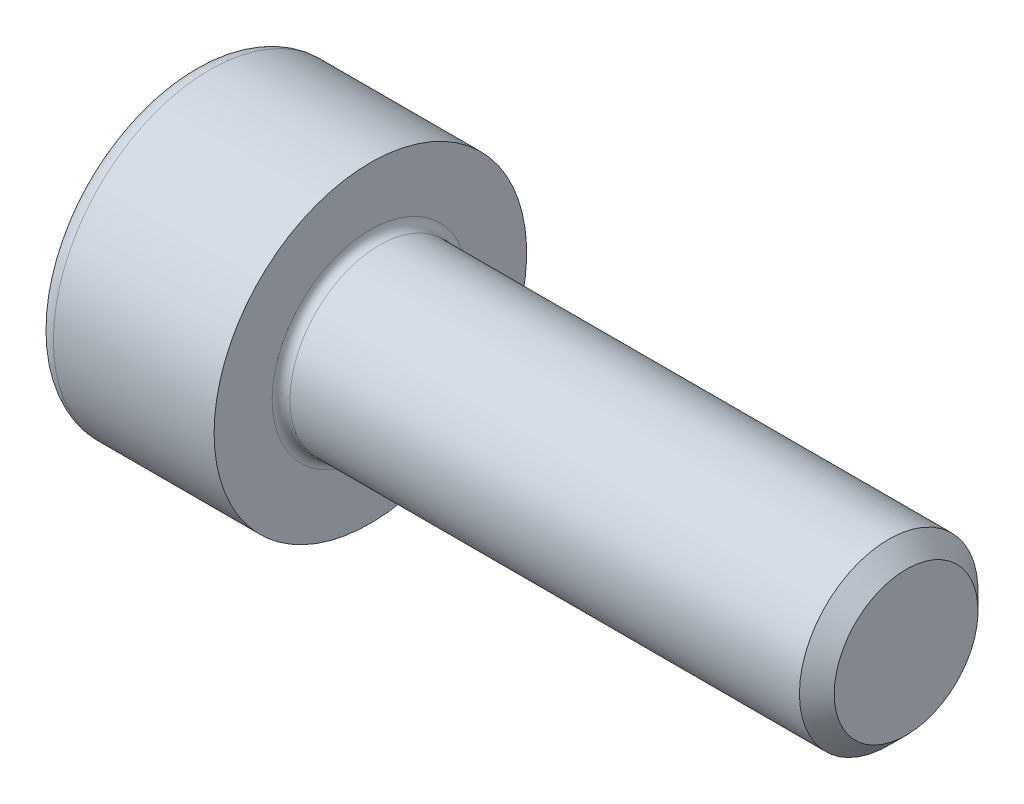
ISO-10303-21;
HEADER;
FILE_DESCRIPTION(('STEP AP214'),'2;1');
FILE_NAME('part.step','',(''),(''),'','','');
FILE_SCHEMA(('AUTOMOTIVE_DESIGN { 1 0 10303 214 1 1 1 1 }'));
ENDSEC;
DATA;
#1=APPLICATION_CONTEXT('core data for automotive mechanical design processes');
#2=APPLICATION_PROTOCOL_DEFINITION('international standard','automotive_design',2000,#1);
#3=PRODUCT_CONTEXT('',#1,'mechanical');
#4=PRODUCT('Part','Part','',(#3));
#5=PRODUCT_RELATED_PRODUCT_CATEGORY('part','',(#4));
#6=PRODUCT_DEFINITION_FORMATION('','',#4);
#7=PRODUCT_DEFINITION_CONTEXT('part definition',#1,'design');
#8=PRODUCT_DEFINITION('design','',#6,#7);
#9=PRODUCT_DEFINITION_SHAPE('','',#8);
#10=(LENGTH_UNIT() NAMED_UNIT(*) SI_UNIT(.MILLI.,.METRE.));
#11=(NAMED_UNIT(*) PLANE_ANGLE_UNIT() SI_UNIT($,.RADIAN.));
#12=(NAMED_UNIT(*) SI_UNIT($,.STERADIAN.) SOLID_ANGLE_UNIT());
#13=UNCERTAINTY_MEASURE_WITH_UNIT(LENGTH_MEASURE(1.E-05),#10,'distance_accuracy_value','');
#14=(GEOMETRIC_REPRESENTATION_CONTEXT(3) GLOBAL_UNCERTAINTY_ASSIGNED_CONTEXT((#13)) GLOBAL_UNIT_ASSIGNED_CONTEXT((#10,
#11,#12)) REPRESENTATION_CONTEXT('',''));
#15=CARTESIAN_POINT('',(0.,0.,0.));
#16=DIRECTION('',(0.,0.,1.));
#17=DIRECTION('',(1.,0.,0.));
#18=AXIS2_PLACEMENT_3D('',#15,#16,#17);
#19=CARTESIAN_POINT('',(0.,0.,0.));
#20=DIRECTION('',(-1.,0.,0.));
#21=DIRECTION('',(0.,0.,1.));
#22=AXIS2_PLACEMENT_3D('',#19,#20,#21);
#23=PLANE('',#22);
#24=DIRECTION('',(0.,-0.499999999999998,0.86602540378444));
#25=VECTOR('',#24,1.);
#26=CARTESIAN_POINT('',(0.,1.74359781295266,0.));
#27=LINE('',#26,#25);
#28=CARTESIAN_POINT('',(0.,1.74359781295266,0.));
#29=VERTEX_POINT('',#28);
#30=CARTESIAN_POINT('',(0.,0.871798906476331,1.51));
#31=VERTEX_POINT('',#30);
#32=EDGE_CURVE('E262',#29,#31,#27,.T.);
#33=ORIENTED_EDGE('',*,*,#32,.T.);
#34=DIRECTION('',(0.,1.,0.));
#35=VECTOR('',#34,1.);
#36=CARTESIAN_POINT('',(0.,-0.871798906476338,1.51));
#37=LINE('',#36,#35);
#38=CARTESIAN_POINT('',(0.,-0.871798906476338,1.51));
#39=VERTEX_POINT('',#38);
#40=EDGE_CURVE('E134',#39,#31,#37,.T.);
#41=ORIENTED_EDGE('',*,*,#40,.F.);
#42=DIRECTION('',(0.,-0.500000000000001,-0.866025403784438));
#43=VECTOR('',#42,1.);
#44=CARTESIAN_POINT('',(0.,-0.871798906476338,1.51));
#45=LINE('',#44,#43);
#46=CARTESIAN_POINT('',(0.,-1.74359781295267,0.));
#47=VERTEX_POINT('',#46);
#48=EDGE_CURVE('E265',#39,#47,#45,.T.);
#49=ORIENTED_EDGE('',*,*,#48,.T.);
#50=DIRECTION('',(0.,0.499999999999998,-0.86602540378444));
#51=VECTOR('',#50,1.);
#52=CARTESIAN_POINT('',(0.,-1.74359781295267,0.));
#53=LINE('',#52,#51);
#54=CARTESIAN_POINT('',(0.,-0.871798906476343,-1.51));
#55=VERTEX_POINT('',#54);
#56=EDGE_CURVE('E268',#47,#55,#53,.T.);
#57=ORIENTED_EDGE('',*,*,#56,.T.);
#58=DIRECTION('',(0.,-1.,0.));
#59=VECTOR('',#58,1.);
#60=CARTESIAN_POINT('',(0.,0.871798906476327,-1.51));
#61=LINE('',#60,#59);
#62=CARTESIAN_POINT('',(0.,0.871798906476327,-1.51));
#63=VERTEX_POINT('',#62);
#64=EDGE_CURVE('E271',#63,#55,#61,.T.);
#65=ORIENTED_EDGE('',*,*,#64,.F.);
#66=DIRECTION('',(0.,-0.500000000000001,-0.866025403784438));
#67=VECTOR('',#66,1.);
#68=CARTESIAN_POINT('',(0.,1.74359781295266,0.));
#69=LINE('',#68,#67);
#70=EDGE_CURVE('E129',#29,#63,#69,.T.);
#71=ORIENTED_EDGE('',*,*,#70,.F.);
#72=EDGE_LOOP('',(#33,#41,#49,#57,#65,#71));
#73=FACE_BOUND('',#72,.T.);
#74=CARTESIAN_POINT('',(0.,0.,0.));
#75=DIRECTION('',(-1.,0.,0.));
#76=DIRECTION('',(0.,0.,1.));
#77=AXIS2_PLACEMENT_3D('',#74,#75,#76);
#78=CIRCLE('',#77,3.1);
#79=CARTESIAN_POINT('',(0.,0.,3.1));
#80=VERTEX_POINT('',#79);
#81=EDGE_CURVE('E46',#80,#80,#78,.T.);
#82=ORIENTED_EDGE('',*,*,#81,.T.);
#83=EDGE_LOOP('',(#82));
#84=FACE_BOUND('',#83,.T.);
#85=ADVANCED_FACE('F38',(#73,#84),#23,.T.);
#86=CARTESIAN_POINT('',(-31.75,0.,0.));
#87=DIRECTION('',(-1.,0.,0.));
#88=DIRECTION('',(0.,0.,1.));
#89=AXIS2_PLACEMENT_3D('',#86,#87,#88);
#90=CYLINDRICAL_SURFACE('',#89,3.5);
#91=CARTESIAN_POINT('',(0.399999999999998,0.,0.));
#92=DIRECTION('',(-1.,0.,0.));
#93=DIRECTION('',(0.,0.,1.));
#94=AXIS2_PLACEMENT_3D('',#91,#92,#93);
#95=CIRCLE('',#94,3.5);
#96=CARTESIAN_POINT('',(0.399999999999998,0.,3.5));
#97=VERTEX_POINT('',#96);
#98=EDGE_CURVE('E11',#97,#97,#95,.F.);
#99=ORIENTED_EDGE('',*,*,#98,.T.);
#100=EDGE_LOOP('',(#99));
#101=FACE_BOUND('',#100,.T.);
#102=CARTESIAN_POINT('',(4.,0.,0.));
#103=DIRECTION('',(-1.,0.,0.));
#104=DIRECTION('',(0.,0.,1.));
#105=AXIS2_PLACEMENT_3D('',#102,#103,#104);
#106=CIRCLE('',#105,3.5);
#107=CARTESIAN_POINT('',(4.,0.,3.5));
#108=VERTEX_POINT('',#107);
#109=EDGE_CURVE('E152',#108,#108,#106,.T.);
#110=ORIENTED_EDGE('',*,*,#109,.T.);
#111=EDGE_LOOP('',(#110));
#112=FACE_BOUND('',#111,.T.);
#113=ADVANCED_FACE('F176',(#101,#112),#90,.T.);
#114=CARTESIAN_POINT('',(4.,3.5,0.));
#115=DIRECTION('',(1.,0.,0.));
#116=DIRECTION('',(0.,0.,-1.));
#117=AXIS2_PLACEMENT_3D('',#114,#115,#116);
#118=PLANE('',#117);
#119=CARTESIAN_POINT('',(4.,0.,0.));
#120=DIRECTION('',(1.,0.,0.));
#121=DIRECTION('',(0.,0.,-1.));
#122=AXIS2_PLACEMENT_3D('',#119,#120,#121);
#123=CIRCLE('',#122,2.19999999999999);
#124=CARTESIAN_POINT('',(4.,0.,-2.19999999999999));
#125=VERTEX_POINT('',#124);
#126=EDGE_CURVE('E155',#125,#125,#123,.F.);
#127=ORIENTED_EDGE('',*,*,#126,.T.);
#128=EDGE_LOOP('',(#127));
#129=FACE_BOUND('',#128,.T.);
#130=ORIENTED_EDGE('',*,*,#109,.F.);
#131=EDGE_LOOP('',(#130));
#132=FACE_BOUND('',#131,.T.);
#133=ADVANCED_FACE('F182',(#129,#132),#118,.T.);
#134=CARTESIAN_POINT('',(-31.75,0.,0.));
#135=DIRECTION('',(-1.,0.,0.));
#136=DIRECTION('',(0.,0.,1.));
#137=AXIS2_PLACEMENT_3D('',#134,#135,#136);
#138=CYLINDRICAL_SURFACE('',#137,1.99999999999999);
#139=CARTESIAN_POINT('',(4.2,0.,0.));
#140=DIRECTION('',(1.,0.,0.));
#141=DIRECTION('',(0.,0.,-1.));
#142=AXIS2_PLACEMENT_3D('',#139,#140,#141);
#143=CIRCLE('',#142,1.99999999999999);
#144=CARTESIAN_POINT('',(4.2,0.,-1.99999999999999));
#145=VERTEX_POINT('',#144);
#146=EDGE_CURVE('E158',#145,#145,#143,.T.);
#147=ORIENTED_EDGE('',*,*,#146,.T.);
#148=EDGE_LOOP('',(#147));
#149=FACE_BOUND('',#148,.T.);
#150=CARTESIAN_POINT('',(15.61,0.,0.));
#151=DIRECTION('',(-1.,0.,0.));
#152=DIRECTION('',(0.,0.,1.));
#153=AXIS2_PLACEMENT_3D('',#150,#151,#152);
#154=CIRCLE('',#153,1.99999999999999);
#155=CARTESIAN_POINT('',(15.61,0.,1.99999999999999));
#156=VERTEX_POINT('',#155);
#157=EDGE_CURVE('E149',#156,#156,#154,.T.);
#158=ORIENTED_EDGE('',*,*,#157,.T.);
#159=EDGE_LOOP('',(#158));
#160=FACE_BOUND('',#159,.T.);
#161=ADVANCED_FACE('F188',(#149,#160),#138,.T.);
#162=CARTESIAN_POINT('',(16.,0.,0.));
#163=DIRECTION('',(-1.,0.,0.));
#164=DIRECTION('',(0.,0.,1.));
#165=AXIS2_PLACEMENT_3D('',#162,#163,#164);
#166=CONICAL_SURFACE('',#165,1.61,0.785398163397435);
#167=ORIENTED_EDGE('',*,*,#157,.F.);
#168=EDGE_LOOP('',(#167));
#169=FACE_BOUND('',#168,.T.);
#170=CARTESIAN_POINT('',(16.,0.,0.));
#171=DIRECTION('',(-1.,0.,0.));
#172=DIRECTION('',(0.,0.,1.));
#173=AXIS2_PLACEMENT_3D('',#170,#171,#172);
#174=CIRCLE('',#173,1.61);
#175=CARTESIAN_POINT('',(16.,0.,1.61));
#176=VERTEX_POINT('',#175);
#177=EDGE_CURVE('E145',#176,#176,#174,.T.);
#178=ORIENTED_EDGE('',*,*,#177,.T.);
#179=EDGE_LOOP('',(#178));
#180=FACE_BOUND('',#179,.T.);
#181=ADVANCED_FACE('F192',(#169,#180),#166,.T.);
#182=CARTESIAN_POINT('',(16.,1.61,0.));
#183=DIRECTION('',(1.,0.,0.));
#184=DIRECTION('',(0.,0.,-1.));
#185=AXIS2_PLACEMENT_3D('',#182,#183,#184);
#186=PLANE('',#185);
#187=ORIENTED_EDGE('',*,*,#177,.F.);
#188=EDGE_LOOP('',(#187));
#189=FACE_BOUND('',#188,.T.);
#190=ADVANCED_FACE('F172',(#189),#186,.T.);
#191=CARTESIAN_POINT('',(4.2,0.,0.));
#192=DIRECTION('',(1.,0.,0.));
#193=DIRECTION('',(0.,0.,-1.));
#194=AXIS2_PLACEMENT_3D('',#191,#192,#193);
#195=TOROIDAL_SURFACE('',#194,2.19999999999999,0.2);
#196=ORIENTED_EDGE('',*,*,#146,.F.);
#197=EDGE_LOOP('',(#196));
#198=FACE_BOUND('',#197,.T.);
#199=ORIENTED_EDGE('',*,*,#126,.F.);
#200=EDGE_LOOP('',(#199));
#201=FACE_BOUND('',#200,.T.);
#202=ADVANCED_FACE('F165',(#198,#201),#195,.F.);
#203=CARTESIAN_POINT('',(0.399999999999998,0.,0.));
#204=DIRECTION('',(-1.,0.,0.));
#205=DIRECTION('',(0.,0.,1.));
#206=AXIS2_PLACEMENT_3D('',#203,#204,#205);
#207=TOROIDAL_SURFACE('',#206,3.1,0.4);
#208=ORIENTED_EDGE('',*,*,#98,.F.);
#209=EDGE_LOOP('',(#208));
#210=FACE_BOUND('',#209,.T.);
#211=ORIENTED_EDGE('',*,*,#81,.F.);
#212=EDGE_LOOP('',(#211));
#213=FACE_BOUND('',#212,.T.);
#214=ADVANCED_FACE('F40',(#210,#213),#207,.T.);
#215=CARTESIAN_POINT('',(2.,1.74359781295266,0.));
#216=DIRECTION('',(0.,-0.86602540378444,-0.499999999999998));
#217=DIRECTION('',(0.,0.499999999999998,-0.86602540378444));
#218=AXIS2_PLACEMENT_3D('',#215,#216,#217);
#219=PLANE('',#218);
#220=ORIENTED_EDGE('',*,*,#32,.F.);
#221=DIRECTION('',(-1.,0.,0.));
#222=VECTOR('',#221,1.);
#223=CARTESIAN_POINT('',(2.,1.74359781295266,0.));
#224=LINE('',#223,#222);
#225=CARTESIAN_POINT('',(2.,1.74359781295266,0.));
#226=VERTEX_POINT('',#225);
#227=EDGE_CURVE('E252',#226,#29,#224,.T.);
#228=ORIENTED_EDGE('',*,*,#227,.F.);
#229=DIRECTION('',(0.,-0.499999999999998,0.86602540378444));
#230=VECTOR('',#229,1.);
#231=CARTESIAN_POINT('',(2.,1.74359781295266,0.));
#232=LINE('',#231,#230);
#233=CARTESIAN_POINT('',(2.,1.3076983597145,0.754999999999994));
#234=VERTEX_POINT('',#233);
#235=EDGE_CURVE('E121',#226,#234,#232,.T.);
#236=ORIENTED_EDGE('',*,*,#235,.T.);
#237=CARTESIAN_POINT('',(2.,0.871798906476331,1.51));
#238=VERTEX_POINT('',#237);
#239=EDGE_CURVE('E112',#234,#238,#232,.T.);
#240=ORIENTED_EDGE('',*,*,#239,.T.);
#241=DIRECTION('',(-1.,0.,0.));
#242=VECTOR('',#241,1.);
#243=CARTESIAN_POINT('',(2.,0.871798906476331,1.51));
#244=LINE('',#243,#242);
#245=EDGE_CURVE('E126',#238,#31,#244,.T.);
#246=ORIENTED_EDGE('',*,*,#245,.T.);
#247=EDGE_LOOP('',(#220,#228,#236,#240,#246));
#248=FACE_BOUND('',#247,.T.);
#249=ADVANCED_FACE('F125',(#248),#219,.T.);
#250=CARTESIAN_POINT('',(2.,-0.871798906476338,1.51));
#251=DIRECTION('',(0.,0.,1.));
#252=DIRECTION('',(0.,-1.,0.));
#253=AXIS2_PLACEMENT_3D('',#250,#251,#252);
#254=PLANE('',#253);
#255=ORIENTED_EDGE('',*,*,#40,.T.);
#256=ORIENTED_EDGE('',*,*,#245,.F.);
#257=DIRECTION('',(0.,1.,0.));
#258=VECTOR('',#257,1.);
#259=CARTESIAN_POINT('',(2.,-0.871798906476338,1.51));
#260=LINE('',#259,#258);
#261=CARTESIAN_POINT('',(2.,0.,1.51));
#262=VERTEX_POINT('',#261);
#263=EDGE_CURVE('E109',#262,#238,#260,.T.);
#264=ORIENTED_EDGE('',*,*,#263,.F.);
#265=CARTESIAN_POINT('',(2.,-0.871798906476338,1.51));
#266=VERTEX_POINT('',#265);
#267=EDGE_CURVE('E120',#266,#262,#260,.T.);
#268=ORIENTED_EDGE('',*,*,#267,.F.);
#269=DIRECTION('',(-1.,0.,0.));
#270=VECTOR('',#269,1.);
#271=CARTESIAN_POINT('',(2.,-0.871798906476338,1.51));
#272=LINE('',#271,#270);
#273=EDGE_CURVE('E136',#266,#39,#272,.T.);
#274=ORIENTED_EDGE('',*,*,#273,.T.);
#275=EDGE_LOOP('',(#255,#256,#264,#268,#274));
#276=FACE_BOUND('',#275,.T.);
#277=ADVANCED_FACE('F131',(#276),#254,.F.);
#278=CARTESIAN_POINT('',(2.,-0.871798906476338,1.51));
#279=DIRECTION('',(0.,0.866025403784438,-0.500000000000001));
#280=DIRECTION('',(0.,0.500000000000001,0.866025403784438));
#281=AXIS2_PLACEMENT_3D('',#278,#279,#280);
#282=PLANE('',#281);
#283=ORIENTED_EDGE('',*,*,#48,.F.);
#284=ORIENTED_EDGE('',*,*,#273,.F.);
#285=DIRECTION('',(0.,-0.500000000000001,-0.866025403784438));
#286=VECTOR('',#285,1.);
#287=CARTESIAN_POINT('',(2.,-0.871798906476338,1.51));
#288=LINE('',#287,#286);
#289=CARTESIAN_POINT('',(2.,-1.3076983597145,0.755000000000003));
#290=VERTEX_POINT('',#289);
#291=EDGE_CURVE('E291',#266,#290,#288,.T.);
#292=ORIENTED_EDGE('',*,*,#291,.T.);
#293=CARTESIAN_POINT('',(2.,-1.74359781295267,0.));
#294=VERTEX_POINT('',#293);
#295=EDGE_CURVE('E280',#290,#294,#288,.T.);
#296=ORIENTED_EDGE('',*,*,#295,.T.);
#297=DIRECTION('',(-1.,0.,0.));
#298=VECTOR('',#297,1.);
#299=CARTESIAN_POINT('',(2.,-1.74359781295267,0.));
#300=LINE('',#299,#298);
#301=EDGE_CURVE('E141',#294,#47,#300,.T.);
#302=ORIENTED_EDGE('',*,*,#301,.T.);
#303=EDGE_LOOP('',(#283,#284,#292,#296,#302));
#304=FACE_BOUND('',#303,.T.);
#305=ADVANCED_FACE('F206',(#304),#282,.T.);
#306=CARTESIAN_POINT('',(2.,-1.74359781295267,0.));
#307=DIRECTION('',(0.,0.86602540378444,0.499999999999998));
#308=DIRECTION('',(0.,-0.499999999999998,0.86602540378444));
#309=AXIS2_PLACEMENT_3D('',#306,#307,#308);
#310=PLANE('',#309);
#311=ORIENTED_EDGE('',*,*,#56,.F.);
#312=ORIENTED_EDGE('',*,*,#301,.F.);
#313=DIRECTION('',(0.,0.499999999999998,-0.86602540378444));
#314=VECTOR('',#313,1.);
#315=CARTESIAN_POINT('',(2.,-1.74359781295267,0.));
#316=LINE('',#315,#314);
#317=CARTESIAN_POINT('',(2.,-1.30769835971451,-0.754999999999999));
#318=VERTEX_POINT('',#317);
#319=EDGE_CURVE('E258',#294,#318,#316,.T.);
#320=ORIENTED_EDGE('',*,*,#319,.T.);
#321=CARTESIAN_POINT('',(2.,-0.871798906476343,-1.51));
#322=VERTEX_POINT('',#321);
#323=EDGE_CURVE('E290',#318,#322,#316,.T.);
#324=ORIENTED_EDGE('',*,*,#323,.T.);
#325=DIRECTION('',(-1.,0.,0.));
#326=VECTOR('',#325,1.);
#327=CARTESIAN_POINT('',(2.,-0.871798906476343,-1.51));
#328=LINE('',#327,#326);
#329=EDGE_CURVE('E251',#322,#55,#328,.T.);
#330=ORIENTED_EDGE('',*,*,#329,.T.);
#331=EDGE_LOOP('',(#311,#312,#320,#324,#330));
#332=FACE_BOUND('',#331,.T.);
#333=ADVANCED_FACE('F209',(#332),#310,.T.);
#334=CARTESIAN_POINT('',(2.,0.871798906476327,-1.51));
#335=DIRECTION('',(0.,0.,-1.));
#336=DIRECTION('',(0.,1.,0.));
#337=AXIS2_PLACEMENT_3D('',#334,#335,#336);
#338=PLANE('',#337);
#339=ORIENTED_EDGE('',*,*,#64,.T.);
#340=ORIENTED_EDGE('',*,*,#329,.F.);
#341=DIRECTION('',(0.,-1.,0.));
#342=VECTOR('',#341,1.);
#343=CARTESIAN_POINT('',(2.,0.871798906476327,-1.51));
#344=LINE('',#343,#342);
#345=CARTESIAN_POINT('',(2.,0.,-1.51));
#346=VERTEX_POINT('',#345);
#347=EDGE_CURVE('E255',#346,#322,#344,.T.);
#348=ORIENTED_EDGE('',*,*,#347,.F.);
#349=CARTESIAN_POINT('',(2.,0.871798906476327,-1.51));
#350=VERTEX_POINT('',#349);
#351=EDGE_CURVE('E53',#350,#346,#344,.T.);
#352=ORIENTED_EDGE('',*,*,#351,.F.);
#353=DIRECTION('',(-1.,0.,0.));
#354=VECTOR('',#353,1.);
#355=CARTESIAN_POINT('',(2.,0.871798906476327,-1.51));
#356=LINE('',#355,#354);
#357=EDGE_CURVE('E248',#350,#63,#356,.T.);
#358=ORIENTED_EDGE('',*,*,#357,.T.);
#359=EDGE_LOOP('',(#339,#340,#348,#352,#358));
#360=FACE_BOUND('',#359,.T.);
#361=ADVANCED_FACE('F213',(#360),#338,.F.);
#362=CARTESIAN_POINT('',(2.,1.74359781295266,0.));
#363=DIRECTION('',(0.,0.866025403784438,-0.500000000000001));
#364=DIRECTION('',(0.,0.500000000000001,0.866025403784438));
#365=AXIS2_PLACEMENT_3D('',#362,#363,#364);
#366=PLANE('',#365);
#367=ORIENTED_EDGE('',*,*,#70,.T.);
#368=ORIENTED_EDGE('',*,*,#357,.F.);
#369=DIRECTION('',(0.,-0.500000000000001,-0.866025403784438));
#370=VECTOR('',#369,1.);
#371=CARTESIAN_POINT('',(2.,1.74359781295266,0.));
#372=LINE('',#371,#370);
#373=CARTESIAN_POINT('',(2.,1.3076983597145,-0.754999999999999));
#374=VERTEX_POINT('',#373);
#375=EDGE_CURVE('E238',#374,#350,#372,.T.);
#376=ORIENTED_EDGE('',*,*,#375,.F.);
#377=EDGE_CURVE('E244',#226,#374,#372,.T.);
#378=ORIENTED_EDGE('',*,*,#377,.F.);
#379=ORIENTED_EDGE('',*,*,#227,.T.);
#380=EDGE_LOOP('',(#367,#368,#376,#378,#379));
#381=FACE_BOUND('',#380,.T.);
#382=ADVANCED_FACE('F217',(#381),#366,.F.);
#383=CARTESIAN_POINT('',(2.,2.61539671942899,-1.51));
#384=DIRECTION('',(1.,0.,0.));
#385=DIRECTION('',(0.,0.,-1.));
#386=AXIS2_PLACEMENT_3D('',#383,#384,#385);
#387=PLANE('',#386);
#388=ORIENTED_EDGE('',*,*,#347,.T.);
#389=ORIENTED_EDGE('',*,*,#323,.F.);
#390=CARTESIAN_POINT('',(2.,0.,0.));
#391=DIRECTION('',(-1.,0.,0.));
#392=DIRECTION('',(0.,0.,1.));
#393=AXIS2_PLACEMENT_3D('',#390,#391,#392);
#394=CIRCLE('',#393,1.51);
#395=EDGE_CURVE('E286',#346,#318,#394,.T.);
#396=ORIENTED_EDGE('',*,*,#395,.F.);
#397=EDGE_LOOP('',(#388,#389,#396));
#398=FACE_BOUND('',#397,.T.);
#399=ADVANCED_FACE('F221',(#398),#387,.F.);
#400=ORIENTED_EDGE('',*,*,#319,.F.);
#401=ORIENTED_EDGE('',*,*,#295,.F.);
#402=EDGE_CURVE('E139',#318,#290,#394,.T.);
#403=ORIENTED_EDGE('',*,*,#402,.F.);
#404=EDGE_LOOP('',(#400,#401,#403));
#405=FACE_BOUND('',#404,.T.);
#406=ADVANCED_FACE('F224',(#405),#387,.F.);
#407=ORIENTED_EDGE('',*,*,#291,.F.);
#408=ORIENTED_EDGE('',*,*,#267,.T.);
#409=EDGE_CURVE('E135',#290,#262,#394,.T.);
#410=ORIENTED_EDGE('',*,*,#409,.F.);
#411=EDGE_LOOP('',(#407,#408,#410));
#412=FACE_BOUND('',#411,.T.);
#413=ADVANCED_FACE('F229',(#412),#387,.F.);
#414=ORIENTED_EDGE('',*,*,#263,.T.);
#415=ORIENTED_EDGE('',*,*,#239,.F.);
#416=EDGE_CURVE('E115',#262,#234,#394,.T.);
#417=ORIENTED_EDGE('',*,*,#416,.F.);
#418=EDGE_LOOP('',(#414,#415,#417));
#419=FACE_BOUND('',#418,.T.);
#420=ADVANCED_FACE('F111',(#419),#387,.F.);
#421=ORIENTED_EDGE('',*,*,#235,.F.);
#422=ORIENTED_EDGE('',*,*,#377,.T.);
#423=EDGE_CURVE('E146',#234,#374,#394,.T.);
#424=ORIENTED_EDGE('',*,*,#423,.F.);
#425=EDGE_LOOP('',(#421,#422,#424));
#426=FACE_BOUND('',#425,.T.);
#427=ADVANCED_FACE('F232',(#426),#387,.F.);
#428=ORIENTED_EDGE('',*,*,#375,.T.);
#429=ORIENTED_EDGE('',*,*,#351,.T.);
#430=EDGE_CURVE('E241',#374,#346,#394,.T.);
#431=ORIENTED_EDGE('',*,*,#430,.F.);
#432=EDGE_LOOP('',(#428,#429,#431));
#433=FACE_BOUND('',#432,.T.);
#434=ADVANCED_FACE('F202',(#433),#387,.F.);
#435=CARTESIAN_POINT('',(2.,0.,0.));
#436=DIRECTION('',(-1.,0.,0.));
#437=DIRECTION('',(0.,0.,1.));
#438=AXIS2_PLACEMENT_3D('',#435,#436,#437);
#439=CONICAL_SURFACE('',#438,1.51,1.04719755119659);
#440=CARTESIAN_POINT('',(2.87179890647635,0.,0.));
#441=VERTEX_POINT('',#440);
#442=VERTEX_LOOP('',#441);
#443=FACE_BOUND('',#442,.T.);
#444=ORIENTED_EDGE('',*,*,#416,.T.);
#445=ORIENTED_EDGE('',*,*,#423,.T.);
#446=ORIENTED_EDGE('',*,*,#430,.T.);
#447=ORIENTED_EDGE('',*,*,#395,.T.);
#448=ORIENTED_EDGE('',*,*,#402,.T.);
#449=ORIENTED_EDGE('',*,*,#409,.T.);
#450=EDGE_LOOP('',(#444,#445,#446,#447,#448,#449));
#451=FACE_BOUND('',#450,.T.);
#452=ADVANCED_FACE('F200',(#443,#451),#439,.F.);
#453=CLOSED_SHELL('',(#85,#113,#133,#161,#181,#190,#202,#214,#249,#277,#305,#333,#361,#382,#399,
#406,#413,#420,#427,#434,#452));
#454=MANIFOLD_SOLID_BREP('B2',#453);
#455=ADVANCED_BREP_SHAPE_REPRESENTATION('',(#18,#454),#14);
#456=SHAPE_DEFINITION_REPRESENTATION(#9,#455);
ENDSEC;
END-ISO-10303-21;
